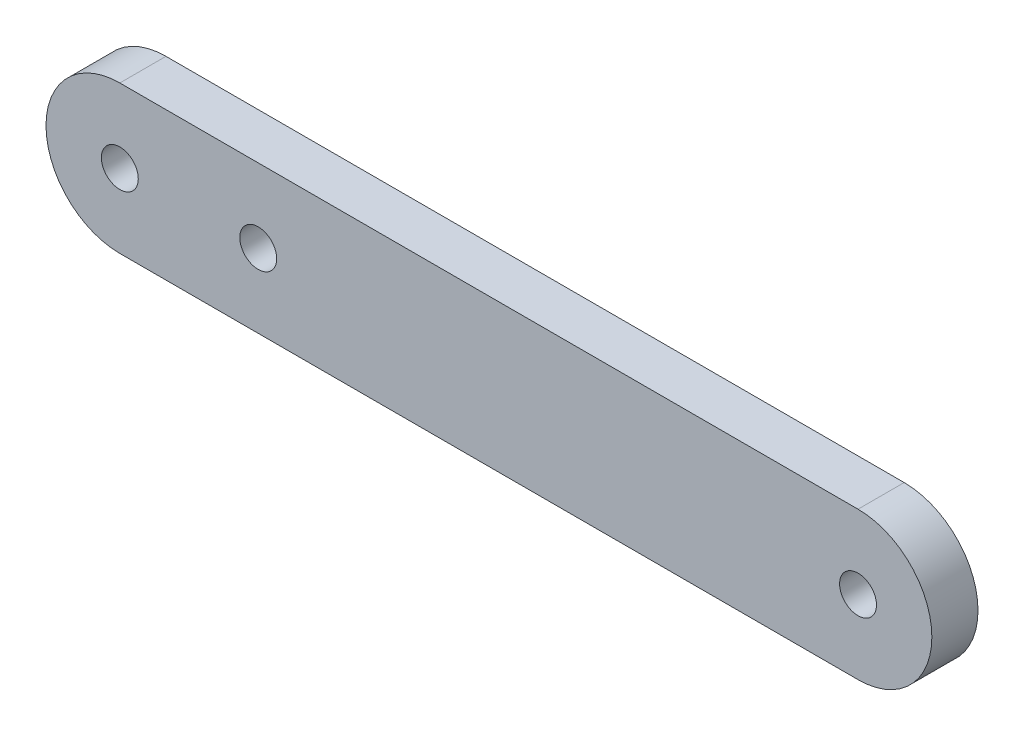
ISO-10303-21;
HEADER;
FILE_DESCRIPTION(('STEP AP214'),'2;1');
FILE_NAME('part.step','',(''),(''),'','','');
FILE_SCHEMA(('AUTOMOTIVE_DESIGN { 1 0 10303 214 1 1 1 1 }'));
ENDSEC;
DATA;
#1=APPLICATION_CONTEXT('core data for automotive mechanical design processes');
#2=APPLICATION_PROTOCOL_DEFINITION('international standard','automotive_design',2000,#1);
#3=PRODUCT_CONTEXT('',#1,'mechanical');
#4=PRODUCT('Part','Part','',(#3));
#5=PRODUCT_RELATED_PRODUCT_CATEGORY('part','',(#4));
#6=PRODUCT_DEFINITION_FORMATION('','',#4);
#7=PRODUCT_DEFINITION_CONTEXT('part definition',#1,'design');
#8=PRODUCT_DEFINITION('design','',#6,#7);
#9=PRODUCT_DEFINITION_SHAPE('','',#8);
#10=(LENGTH_UNIT() NAMED_UNIT(*) SI_UNIT(.MILLI.,.METRE.));
#11=(NAMED_UNIT(*) PLANE_ANGLE_UNIT() SI_UNIT($,.RADIAN.));
#12=(NAMED_UNIT(*) SI_UNIT($,.STERADIAN.) SOLID_ANGLE_UNIT());
#13=UNCERTAINTY_MEASURE_WITH_UNIT(LENGTH_MEASURE(1.E-05),#10,'distance_accuracy_value','');
#14=(GEOMETRIC_REPRESENTATION_CONTEXT(3) GLOBAL_UNCERTAINTY_ASSIGNED_CONTEXT((#13)) GLOBAL_UNIT_ASSIGNED_CONTEXT((#10,
#11,#12)) REPRESENTATION_CONTEXT('',''));
#15=CARTESIAN_POINT('',(0.,0.,0.));
#16=DIRECTION('',(0.,0.,1.));
#17=DIRECTION('',(1.,0.,0.));
#18=AXIS2_PLACEMENT_3D('',#15,#16,#17);
#19=CARTESIAN_POINT('',(40.,0.,5.));
#20=DIRECTION('',(0.,0.,-1.));
#21=DIRECTION('',(-1.,0.,0.));
#22=AXIS2_PLACEMENT_3D('',#19,#20,#21);
#23=CYLINDRICAL_SURFACE('',#22,8.);
#24=CARTESIAN_POINT('',(40.,0.,0.));
#25=DIRECTION('',(0.,0.,1.));
#26=DIRECTION('',(1.,0.,0.));
#27=AXIS2_PLACEMENT_3D('',#24,#25,#26);
#28=CIRCLE('',#27,8.);
#29=CARTESIAN_POINT('',(40.,8.,0.));
#30=VERTEX_POINT('',#29);
#31=CARTESIAN_POINT('',(40.,-8.,0.));
#32=VERTEX_POINT('',#31);
#33=EDGE_CURVE('E114',#30,#32,#28,.F.);
#34=ORIENTED_EDGE('',*,*,#33,.F.);
#35=DIRECTION('',(0.,0.,-1.));
#36=VECTOR('',#35,1.);
#37=CARTESIAN_POINT('',(40.,8.,5.));
#38=LINE('',#37,#36);
#39=CARTESIAN_POINT('',(40.,8.,5.));
#40=VERTEX_POINT('',#39);
#41=EDGE_CURVE('E11',#40,#30,#38,.T.);
#42=ORIENTED_EDGE('',*,*,#41,.F.);
#43=CARTESIAN_POINT('',(40.,0.,5.));
#44=DIRECTION('',(0.,0.,1.));
#45=DIRECTION('',(1.,0.,0.));
#46=AXIS2_PLACEMENT_3D('',#43,#44,#45);
#47=CIRCLE('',#46,8.);
#48=CARTESIAN_POINT('',(40.,-8.,5.));
#49=VERTEX_POINT('',#48);
#50=EDGE_CURVE('E98',#40,#49,#47,.F.);
#51=ORIENTED_EDGE('',*,*,#50,.T.);
#52=DIRECTION('',(0.,0.,-1.));
#53=VECTOR('',#52,1.);
#54=CARTESIAN_POINT('',(40.,-8.,5.));
#55=LINE('',#54,#53);
#56=EDGE_CURVE('E76',#49,#32,#55,.T.);
#57=ORIENTED_EDGE('',*,*,#56,.T.);
#58=EDGE_LOOP('',(#34,#42,#51,#57));
#59=FACE_BOUND('',#58,.T.);
#60=ADVANCED_FACE('F36',(#59),#23,.T.);
#61=CARTESIAN_POINT('',(0.,8.,5.));
#62=DIRECTION('',(0.,1.,0.));
#63=DIRECTION('',(0.,0.,1.));
#64=AXIS2_PLACEMENT_3D('',#61,#62,#63);
#65=PLANE('',#64);
#66=DIRECTION('',(1.,0.,0.));
#67=VECTOR('',#66,1.);
#68=CARTESIAN_POINT('',(0.,8.,0.));
#69=LINE('',#68,#67);
#70=CARTESIAN_POINT('',(-40.,8.,0.));
#71=VERTEX_POINT('',#70);
#72=EDGE_CURVE('E88',#71,#30,#69,.T.);
#73=ORIENTED_EDGE('',*,*,#72,.F.);
#74=DIRECTION('',(0.,0.,-1.));
#75=VECTOR('',#74,1.);
#76=CARTESIAN_POINT('',(-40.,8.,5.));
#77=LINE('',#76,#75);
#78=CARTESIAN_POINT('',(-40.,8.,5.));
#79=VERTEX_POINT('',#78);
#80=EDGE_CURVE('E45',#79,#71,#77,.T.);
#81=ORIENTED_EDGE('',*,*,#80,.F.);
#82=DIRECTION('',(1.,0.,0.));
#83=VECTOR('',#82,1.);
#84=CARTESIAN_POINT('',(0.,8.,5.));
#85=LINE('',#84,#83);
#86=EDGE_CURVE('E86',#79,#40,#85,.T.);
#87=ORIENTED_EDGE('',*,*,#86,.T.);
#88=ORIENTED_EDGE('',*,*,#41,.T.);
#89=EDGE_LOOP('',(#73,#81,#87,#88));
#90=FACE_BOUND('',#89,.T.);
#91=ADVANCED_FACE('F84',(#90),#65,.T.);
#92=CARTESIAN_POINT('',(-40.,0.,5.));
#93=DIRECTION('',(0.,0.,-1.));
#94=DIRECTION('',(-1.,0.,0.));
#95=AXIS2_PLACEMENT_3D('',#92,#93,#94);
#96=CYLINDRICAL_SURFACE('',#95,8.);
#97=CARTESIAN_POINT('',(-40.,0.,0.));
#98=DIRECTION('',(0.,0.,1.));
#99=DIRECTION('',(1.,0.,0.));
#100=AXIS2_PLACEMENT_3D('',#97,#98,#99);
#101=CIRCLE('',#100,8.);
#102=CARTESIAN_POINT('',(-40.,-8.,0.));
#103=VERTEX_POINT('',#102);
#104=EDGE_CURVE('E117',#71,#103,#101,.T.);
#105=ORIENTED_EDGE('',*,*,#104,.T.);
#106=DIRECTION('',(0.,0.,-1.));
#107=VECTOR('',#106,1.);
#108=CARTESIAN_POINT('',(-40.,-8.,5.));
#109=LINE('',#108,#107);
#110=CARTESIAN_POINT('',(-40.,-8.,5.));
#111=VERTEX_POINT('',#110);
#112=EDGE_CURVE('E91',#111,#103,#109,.T.);
#113=ORIENTED_EDGE('',*,*,#112,.F.);
#114=CARTESIAN_POINT('',(-40.,0.,5.));
#115=DIRECTION('',(0.,0.,1.));
#116=DIRECTION('',(1.,0.,0.));
#117=AXIS2_PLACEMENT_3D('',#114,#115,#116);
#118=CIRCLE('',#117,8.);
#119=EDGE_CURVE('E93',#79,#111,#118,.T.);
#120=ORIENTED_EDGE('',*,*,#119,.F.);
#121=ORIENTED_EDGE('',*,*,#80,.T.);
#122=EDGE_LOOP('',(#105,#113,#120,#121));
#123=FACE_BOUND('',#122,.T.);
#124=ADVANCED_FACE('F94',(#123),#96,.T.);
#125=CARTESIAN_POINT('',(-40.,0.,5.));
#126=DIRECTION('',(0.,0.,-1.));
#127=DIRECTION('',(-1.,0.,0.));
#128=AXIS2_PLACEMENT_3D('',#125,#126,#127);
#129=CYLINDRICAL_SURFACE('',#128,2.);
#130=CARTESIAN_POINT('',(-40.,0.,5.));
#131=DIRECTION('',(0.,0.,1.));
#132=DIRECTION('',(1.,0.,0.));
#133=AXIS2_PLACEMENT_3D('',#130,#131,#132);
#134=CIRCLE('',#133,2.);
#135=CARTESIAN_POINT('',(-38.,0.,5.));
#136=VERTEX_POINT('',#135);
#137=EDGE_CURVE('E105',#136,#136,#134,.T.);
#138=ORIENTED_EDGE('',*,*,#137,.T.);
#139=EDGE_LOOP('',(#138));
#140=FACE_BOUND('',#139,.T.);
#141=CARTESIAN_POINT('',(-40.,0.,0.));
#142=DIRECTION('',(0.,0.,1.));
#143=DIRECTION('',(1.,0.,0.));
#144=AXIS2_PLACEMENT_3D('',#141,#142,#143);
#145=CIRCLE('',#144,2.);
#146=CARTESIAN_POINT('',(-38.,0.,0.));
#147=VERTEX_POINT('',#146);
#148=EDGE_CURVE('E120',#147,#147,#145,.T.);
#149=ORIENTED_EDGE('',*,*,#148,.F.);
#150=EDGE_LOOP('',(#149));
#151=FACE_BOUND('',#150,.T.);
#152=ADVANCED_FACE('F139',(#140,#151),#129,.F.);
#153=CARTESIAN_POINT('',(0.,-8.,5.));
#154=DIRECTION('',(0.,1.,0.));
#155=DIRECTION('',(0.,0.,1.));
#156=AXIS2_PLACEMENT_3D('',#153,#154,#155);
#157=PLANE('',#156);
#158=DIRECTION('',(1.,0.,0.));
#159=VECTOR('',#158,1.);
#160=CARTESIAN_POINT('',(0.,-8.,0.));
#161=LINE('',#160,#159);
#162=EDGE_CURVE('E69',#103,#32,#161,.T.);
#163=ORIENTED_EDGE('',*,*,#162,.T.);
#164=ORIENTED_EDGE('',*,*,#56,.F.);
#165=DIRECTION('',(1.,0.,0.));
#166=VECTOR('',#165,1.);
#167=CARTESIAN_POINT('',(0.,-8.,5.));
#168=LINE('',#167,#166);
#169=EDGE_CURVE('E53',#111,#49,#168,.T.);
#170=ORIENTED_EDGE('',*,*,#169,.F.);
#171=ORIENTED_EDGE('',*,*,#112,.T.);
#172=EDGE_LOOP('',(#163,#164,#170,#171));
#173=FACE_BOUND('',#172,.T.);
#174=ADVANCED_FACE('F128',(#173),#157,.F.);
#175=CARTESIAN_POINT('',(-25.,0.,5.));
#176=DIRECTION('',(0.,0.,-1.));
#177=DIRECTION('',(-1.,0.,0.));
#178=AXIS2_PLACEMENT_3D('',#175,#176,#177);
#179=CYLINDRICAL_SURFACE('',#178,2.);
#180=CARTESIAN_POINT('',(-25.,0.,5.));
#181=DIRECTION('',(0.,0.,1.));
#182=DIRECTION('',(1.,0.,0.));
#183=AXIS2_PLACEMENT_3D('',#180,#181,#182);
#184=CIRCLE('',#183,2.);
#185=CARTESIAN_POINT('',(-23.,0.,5.));
#186=VERTEX_POINT('',#185);
#187=EDGE_CURVE('E100',#186,#186,#184,.T.);
#188=ORIENTED_EDGE('',*,*,#187,.T.);
#189=EDGE_LOOP('',(#188));
#190=FACE_BOUND('',#189,.T.);
#191=CARTESIAN_POINT('',(-25.,0.,0.));
#192=DIRECTION('',(0.,0.,1.));
#193=DIRECTION('',(1.,0.,0.));
#194=AXIS2_PLACEMENT_3D('',#191,#192,#193);
#195=CIRCLE('',#194,2.);
#196=CARTESIAN_POINT('',(-23.,0.,0.));
#197=VERTEX_POINT('',#196);
#198=EDGE_CURVE('E111',#197,#197,#195,.T.);
#199=ORIENTED_EDGE('',*,*,#198,.F.);
#200=EDGE_LOOP('',(#199));
#201=FACE_BOUND('',#200,.T.);
#202=ADVANCED_FACE('F38',(#190,#201),#179,.F.);
#203=CARTESIAN_POINT('',(40.,0.,5.));
#204=DIRECTION('',(0.,0.,-1.));
#205=DIRECTION('',(-1.,0.,0.));
#206=AXIS2_PLACEMENT_3D('',#203,#204,#205);
#207=CYLINDRICAL_SURFACE('',#206,2.);
#208=CARTESIAN_POINT('',(40.,0.,5.));
#209=DIRECTION('',(0.,0.,1.));
#210=DIRECTION('',(1.,0.,0.));
#211=AXIS2_PLACEMENT_3D('',#208,#209,#210);
#212=CIRCLE('',#211,2.);
#213=CARTESIAN_POINT('',(42.,0.,5.));
#214=VERTEX_POINT('',#213);
#215=EDGE_CURVE('E108',#214,#214,#212,.F.);
#216=ORIENTED_EDGE('',*,*,#215,.F.);
#217=EDGE_LOOP('',(#216));
#218=FACE_BOUND('',#217,.T.);
#219=CARTESIAN_POINT('',(40.,0.,0.));
#220=DIRECTION('',(0.,0.,1.));
#221=DIRECTION('',(1.,0.,0.));
#222=AXIS2_PLACEMENT_3D('',#219,#220,#221);
#223=CIRCLE('',#222,2.);
#224=CARTESIAN_POINT('',(42.,0.,0.));
#225=VERTEX_POINT('',#224);
#226=EDGE_CURVE('E123',#225,#225,#223,.F.);
#227=ORIENTED_EDGE('',*,*,#226,.T.);
#228=EDGE_LOOP('',(#227));
#229=FACE_BOUND('',#228,.T.);
#230=ADVANCED_FACE('F145',(#218,#229),#207,.F.);
#231=CARTESIAN_POINT('',(0.,0.,5.));
#232=DIRECTION('',(0.,0.,1.));
#233=DIRECTION('',(1.,0.,0.));
#234=AXIS2_PLACEMENT_3D('',#231,#232,#233);
#235=PLANE('',#234);
#236=ORIENTED_EDGE('',*,*,#187,.F.);
#237=EDGE_LOOP('',(#236));
#238=FACE_BOUND('',#237,.T.);
#239=ORIENTED_EDGE('',*,*,#50,.F.);
#240=ORIENTED_EDGE('',*,*,#86,.F.);
#241=ORIENTED_EDGE('',*,*,#119,.T.);
#242=ORIENTED_EDGE('',*,*,#169,.T.);
#243=EDGE_LOOP('',(#239,#240,#241,#242));
#244=FACE_BOUND('',#243,.T.);
#245=ORIENTED_EDGE('',*,*,#137,.F.);
#246=EDGE_LOOP('',(#245));
#247=FACE_BOUND('',#246,.T.);
#248=ORIENTED_EDGE('',*,*,#215,.T.);
#249=EDGE_LOOP('',(#248));
#250=FACE_BOUND('',#249,.T.);
#251=ADVANCED_FACE('F96',(#238,#244,#247,#250),#235,.T.);
#252=CARTESIAN_POINT('',(0.,0.,0.));
#253=DIRECTION('',(0.,0.,1.));
#254=DIRECTION('',(1.,0.,0.));
#255=AXIS2_PLACEMENT_3D('',#252,#253,#254);
#256=PLANE('',#255);
#257=ORIENTED_EDGE('',*,*,#198,.T.);
#258=EDGE_LOOP('',(#257));
#259=FACE_BOUND('',#258,.T.);
#260=ORIENTED_EDGE('',*,*,#33,.T.);
#261=ORIENTED_EDGE('',*,*,#162,.F.);
#262=ORIENTED_EDGE('',*,*,#104,.F.);
#263=ORIENTED_EDGE('',*,*,#72,.T.);
#264=EDGE_LOOP('',(#260,#261,#262,#263));
#265=FACE_BOUND('',#264,.T.);
#266=ORIENTED_EDGE('',*,*,#148,.T.);
#267=EDGE_LOOP('',(#266));
#268=FACE_BOUND('',#267,.T.);
#269=ORIENTED_EDGE('',*,*,#226,.F.);
#270=EDGE_LOOP('',(#269));
#271=FACE_BOUND('',#270,.T.);
#272=ADVANCED_FACE('F129',(#259,#265,#268,#271),#256,.F.);
#273=CLOSED_SHELL('',(#60,#91,#124,#152,#174,#202,#230,#251,#272));
#274=MANIFOLD_SOLID_BREP('B2',#273);
#275=ADVANCED_BREP_SHAPE_REPRESENTATION('',(#18,#274),#14);
#276=SHAPE_DEFINITION_REPRESENTATION(#9,#275);
ENDSEC;
END-ISO-10303-21;
